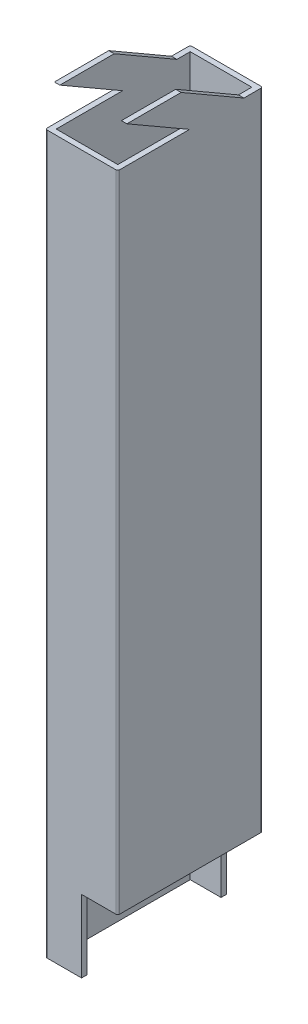
ISO-10303-21;
HEADER;
FILE_DESCRIPTION(('STEP AP214'),'2;1');
FILE_NAME('part.step','',(''),(''),'','','');
FILE_SCHEMA(('AUTOMOTIVE_DESIGN { 1 0 10303 214 1 1 1 1 }'));
ENDSEC;
DATA;
#1=APPLICATION_CONTEXT('core data for automotive mechanical design processes');
#2=APPLICATION_PROTOCOL_DEFINITION('international standard','automotive_design',2000,#1);
#3=PRODUCT_CONTEXT('',#1,'mechanical');
#4=PRODUCT('Part','Part','',(#3));
#5=PRODUCT_RELATED_PRODUCT_CATEGORY('part','',(#4));
#6=PRODUCT_DEFINITION_FORMATION('','',#4);
#7=PRODUCT_DEFINITION_CONTEXT('part definition',#1,'design');
#8=PRODUCT_DEFINITION('design','',#6,#7);
#9=PRODUCT_DEFINITION_SHAPE('','',#8);
#10=(LENGTH_UNIT() NAMED_UNIT(*) SI_UNIT(.MILLI.,.METRE.));
#11=(NAMED_UNIT(*) PLANE_ANGLE_UNIT() SI_UNIT($,.RADIAN.));
#12=(NAMED_UNIT(*) SI_UNIT($,.STERADIAN.) SOLID_ANGLE_UNIT());
#13=UNCERTAINTY_MEASURE_WITH_UNIT(LENGTH_MEASURE(1.E-05),#10,'distance_accuracy_value','');
#14=(GEOMETRIC_REPRESENTATION_CONTEXT(3) GLOBAL_UNCERTAINTY_ASSIGNED_CONTEXT((#13)) GLOBAL_UNIT_ASSIGNED_CONTEXT((#10,
#11,#12)) REPRESENTATION_CONTEXT('',''));
#15=CARTESIAN_POINT('',(0.,0.,0.));
#16=DIRECTION('',(0.,0.,1.));
#17=DIRECTION('',(1.,0.,0.));
#18=AXIS2_PLACEMENT_3D('',#15,#16,#17);
#19=CARTESIAN_POINT('',(19.5,208.,-0.5));
#20=DIRECTION('',(0.,1.,0.));
#21=DIRECTION('',(0.,0.,1.));
#22=AXIS2_PLACEMENT_3D('',#19,#20,#21);
#23=PLANE('',#22);
#24=DIRECTION('',(0.,0.,-1.));
#25=VECTOR('',#24,1.);
#26=CARTESIAN_POINT('',(20.,208.,-0.5));
#27=LINE('',#26,#25);
#28=CARTESIAN_POINT('',(20.,208.,-2.5));
#29=VERTEX_POINT('',#28);
#30=CARTESIAN_POINT('',(20.,208.,-17.5));
#31=VERTEX_POINT('',#30);
#32=EDGE_CURVE('E226',#29,#31,#27,.T.);
#33=ORIENTED_EDGE('',*,*,#32,.T.);
#34=DIRECTION('',(-1.,0.,0.));
#35=VECTOR('',#34,1.);
#36=CARTESIAN_POINT('',(40.,208.,-17.5));
#37=LINE('',#36,#35);
#38=CARTESIAN_POINT('',(18.5,208.,-17.5));
#39=VERTEX_POINT('',#38);
#40=EDGE_CURVE('E217',#31,#39,#37,.T.);
#41=ORIENTED_EDGE('',*,*,#40,.T.);
#42=DIRECTION('',(0.,0.,-1.));
#43=VECTOR('',#42,1.);
#44=CARTESIAN_POINT('',(18.5,208.,-1.5));
#45=LINE('',#44,#43);
#46=CARTESIAN_POINT('',(18.5,208.,-2.5));
#47=VERTEX_POINT('',#46);
#48=EDGE_CURVE('E347',#47,#39,#45,.T.);
#49=ORIENTED_EDGE('',*,*,#48,.F.);
#50=DIRECTION('',(-1.,0.,0.));
#51=VECTOR('',#50,1.);
#52=CARTESIAN_POINT('',(40.,208.,-2.5));
#53=LINE('',#52,#51);
#54=EDGE_CURVE('E51',#29,#47,#53,.T.);
#55=ORIENTED_EDGE('',*,*,#54,.F.);
#56=EDGE_LOOP('',(#33,#41,#49,#55));
#57=FACE_BOUND('',#56,.T.);
#58=ADVANCED_FACE('F36',(#57),#23,.T.);
#59=DIRECTION('',(0.,0.,1.));
#60=VECTOR('',#59,1.);
#61=CARTESIAN_POINT('',(1.5,208.,-1.5));
#62=LINE('',#61,#60);
#63=CARTESIAN_POINT('',(1.5,208.,-17.5));
#64=VERTEX_POINT('',#63);
#65=CARTESIAN_POINT('',(1.5,208.,-2.5));
#66=VERTEX_POINT('',#65);
#67=EDGE_CURVE('E216',#64,#66,#62,.T.);
#68=ORIENTED_EDGE('',*,*,#67,.F.);
#69=CARTESIAN_POINT('',(0.,208.,-17.5));
#70=VERTEX_POINT('',#69);
#71=EDGE_CURVE('E200',#64,#70,#37,.T.);
#72=ORIENTED_EDGE('',*,*,#71,.T.);
#73=DIRECTION('',(0.,0.,1.));
#74=VECTOR('',#73,1.);
#75=CARTESIAN_POINT('',(0.,208.,-0.500000000000004));
#76=LINE('',#75,#74);
#77=CARTESIAN_POINT('',(0.,208.,-2.5));
#78=VERTEX_POINT('',#77);
#79=EDGE_CURVE('E214',#70,#78,#76,.T.);
#80=ORIENTED_EDGE('',*,*,#79,.T.);
#81=EDGE_CURVE('E392',#66,#78,#53,.T.);
#82=ORIENTED_EDGE('',*,*,#81,.F.);
#83=EDGE_LOOP('',(#68,#72,#80,#82));
#84=FACE_BOUND('',#83,.T.);
#85=ADVANCED_FACE('F212',(#84),#23,.T.);
#86=CARTESIAN_POINT('',(19.5,208.,-0.5));
#87=DIRECTION('',(0.,-1.,0.));
#88=DIRECTION('',(0.,0.,-1.));
#89=AXIS2_PLACEMENT_3D('',#86,#87,#88);
#90=CYLINDRICAL_SURFACE('',#89,0.5);
#91=CARTESIAN_POINT('',(19.5,198.,-0.5));
#92=DIRECTION('',(0.,1.,0.));
#93=DIRECTION('',(0.,0.,1.));
#94=AXIS2_PLACEMENT_3D('',#91,#92,#93);
#95=CIRCLE('',#94,0.5);
#96=CARTESIAN_POINT('',(19.5,198.,0.));
#97=VERTEX_POINT('',#96);
#98=CARTESIAN_POINT('',(20.,198.,-0.5));
#99=VERTEX_POINT('',#98);
#100=EDGE_CURVE('E304',#97,#99,#95,.T.);
#101=ORIENTED_EDGE('',*,*,#100,.F.);
#102=DIRECTION('',(0.,-1.,0.));
#103=VECTOR('',#102,1.);
#104=CARTESIAN_POINT('',(19.5,208.,0.));
#105=LINE('',#104,#103);
#106=CARTESIAN_POINT('',(19.5,20.,0.));
#107=VERTEX_POINT('',#106);
#108=EDGE_CURVE('E225',#97,#107,#105,.T.);
#109=ORIENTED_EDGE('',*,*,#108,.T.);
#110=CARTESIAN_POINT('',(19.5,20.,-0.5));
#111=DIRECTION('',(0.,1.,0.));
#112=DIRECTION('',(0.,0.,1.));
#113=AXIS2_PLACEMENT_3D('',#110,#111,#112);
#114=CIRCLE('',#113,0.5);
#115=CARTESIAN_POINT('',(20.,20.,-0.5));
#116=VERTEX_POINT('',#115);
#117=EDGE_CURVE('E340',#107,#116,#114,.T.);
#118=ORIENTED_EDGE('',*,*,#117,.T.);
#119=DIRECTION('',(0.,-1.,0.));
#120=VECTOR('',#119,1.);
#121=CARTESIAN_POINT('',(20.,208.,-0.5));
#122=LINE('',#121,#120);
#123=EDGE_CURVE('E261',#99,#116,#122,.T.);
#124=ORIENTED_EDGE('',*,*,#123,.F.);
#125=EDGE_LOOP('',(#101,#109,#118,#124));
#126=FACE_BOUND('',#125,.T.);
#127=ADVANCED_FACE('F38',(#126),#90,.T.);
#128=CARTESIAN_POINT('',(20.,208.,-0.5));
#129=DIRECTION('',(-1.,0.,0.));
#130=DIRECTION('',(0.,0.,1.));
#131=AXIS2_PLACEMENT_3D('',#128,#129,#130);
#132=PLANE('',#131);
#133=DIRECTION('',(0.,-0.500000000000001,-0.866025403784438));
#134=VECTOR('',#133,1.);
#135=CARTESIAN_POINT('',(20.,215.361215932168,-4.75000000000001));
#136=LINE('',#135,#134);
#137=CARTESIAN_POINT('',(20.,198.,-34.8205080756887));
#138=VERTEX_POINT('',#137);
#139=EDGE_CURVE('E308',#31,#138,#136,.T.);
#140=ORIENTED_EDGE('',*,*,#139,.F.);
#141=ORIENTED_EDGE('',*,*,#32,.F.);
#142=DIRECTION('',(0.,0.500000000000002,0.866025403784438));
#143=VECTOR('',#142,1.);
#144=CARTESIAN_POINT('',(20.,208.866025403784,-1.));
#145=LINE('',#144,#143);
#146=CARTESIAN_POINT('',(20.,198.,-19.8205080756887));
#147=VERTEX_POINT('',#146);
#148=EDGE_CURVE('E293',#147,#29,#145,.T.);
#149=ORIENTED_EDGE('',*,*,#148,.F.);
#150=DIRECTION('',(0.,0.,-1.));
#151=VECTOR('',#150,1.);
#152=CARTESIAN_POINT('',(20.,198.,-0.5));
#153=LINE('',#152,#151);
#154=EDGE_CURVE('E302',#99,#147,#153,.T.);
#155=ORIENTED_EDGE('',*,*,#154,.F.);
#156=ORIENTED_EDGE('',*,*,#123,.T.);
#157=DIRECTION('',(0.,0.,1.));
#158=VECTOR('',#157,1.);
#159=CARTESIAN_POINT('',(20.,20.,-40.));
#160=LINE('',#159,#158);
#161=CARTESIAN_POINT('',(20.,20.,-39.5));
#162=VERTEX_POINT('',#161);
#163=EDGE_CURVE('E318',#162,#116,#160,.T.);
#164=ORIENTED_EDGE('',*,*,#163,.F.);
#165=DIRECTION('',(0.,-1.,0.));
#166=VECTOR('',#165,1.);
#167=CARTESIAN_POINT('',(20.,208.,-39.5));
#168=LINE('',#167,#166);
#169=CARTESIAN_POINT('',(20.,198.,-39.5));
#170=VERTEX_POINT('',#169);
#171=EDGE_CURVE('E259',#170,#162,#168,.T.);
#172=ORIENTED_EDGE('',*,*,#171,.F.);
#173=DIRECTION('',(0.,0.,-1.));
#174=VECTOR('',#173,1.);
#175=CARTESIAN_POINT('',(20.,198.,-0.5));
#176=LINE('',#175,#174);
#177=EDGE_CURVE('E388',#138,#170,#176,.T.);
#178=ORIENTED_EDGE('',*,*,#177,.F.);
#179=EDGE_LOOP('',(#140,#141,#149,#155,#156,#164,#172,#178));
#180=FACE_BOUND('',#179,.T.);
#181=ADVANCED_FACE('F428',(#180),#132,.F.);
#182=CARTESIAN_POINT('',(19.5,208.,-39.5));
#183=DIRECTION('',(0.,-1.,0.));
#184=DIRECTION('',(0.,0.,-1.));
#185=AXIS2_PLACEMENT_3D('',#182,#183,#184);
#186=CYLINDRICAL_SURFACE('',#185,0.5);
#187=CARTESIAN_POINT('',(19.5,198.,-39.5));
#188=DIRECTION('',(0.,1.,0.));
#189=DIRECTION('',(0.,0.,1.));
#190=AXIS2_PLACEMENT_3D('',#187,#188,#189);
#191=CIRCLE('',#190,0.5);
#192=CARTESIAN_POINT('',(19.5,198.,-40.));
#193=VERTEX_POINT('',#192);
#194=EDGE_CURVE('E380',#170,#193,#191,.T.);
#195=ORIENTED_EDGE('',*,*,#194,.F.);
#196=ORIENTED_EDGE('',*,*,#171,.T.);
#197=CARTESIAN_POINT('',(19.5,20.,-39.5));
#198=DIRECTION('',(0.,1.,0.));
#199=DIRECTION('',(0.,0.,1.));
#200=AXIS2_PLACEMENT_3D('',#197,#198,#199);
#201=CIRCLE('',#200,0.5);
#202=CARTESIAN_POINT('',(19.5,20.,-40.));
#203=VERTEX_POINT('',#202);
#204=EDGE_CURVE('E337',#162,#203,#201,.T.);
#205=ORIENTED_EDGE('',*,*,#204,.T.);
#206=DIRECTION('',(0.,-1.,0.));
#207=VECTOR('',#206,1.);
#208=CARTESIAN_POINT('',(19.5,208.,-40.));
#209=LINE('',#208,#207);
#210=EDGE_CURVE('E257',#193,#203,#209,.T.);
#211=ORIENTED_EDGE('',*,*,#210,.F.);
#212=EDGE_LOOP('',(#195,#196,#205,#211));
#213=FACE_BOUND('',#212,.T.);
#214=ADVANCED_FACE('F458',(#213),#186,.T.);
#215=CARTESIAN_POINT('',(0.500000000000004,208.,-40.));
#216=DIRECTION('',(0.,0.,1.));
#217=DIRECTION('',(1.,0.,0.));
#218=AXIS2_PLACEMENT_3D('',#215,#216,#217);
#219=PLANE('',#218);
#220=DIRECTION('',(-1.,0.,0.));
#221=VECTOR('',#220,1.);
#222=CARTESIAN_POINT('',(40.,198.,-40.));
#223=LINE('',#222,#221);
#224=CARTESIAN_POINT('',(0.5,198.,-40.));
#225=VERTEX_POINT('',#224);
#226=EDGE_CURVE('E439',#193,#225,#223,.T.);
#227=ORIENTED_EDGE('',*,*,#226,.F.);
#228=ORIENTED_EDGE('',*,*,#210,.T.);
#229=DIRECTION('',(-1.,0.,0.));
#230=VECTOR('',#229,1.);
#231=CARTESIAN_POINT('',(20.,20.,-40.));
#232=LINE('',#231,#230);
#233=CARTESIAN_POINT('',(10.,20.,-40.));
#234=VERTEX_POINT('',#233);
#235=EDGE_CURVE('E311',#203,#234,#232,.T.);
#236=ORIENTED_EDGE('',*,*,#235,.T.);
#237=DIRECTION('',(0.,-1.,0.));
#238=VECTOR('',#237,1.);
#239=CARTESIAN_POINT('',(10.,20.,-40.));
#240=LINE('',#239,#238);
#241=CARTESIAN_POINT('',(10.,0.,-40.));
#242=VERTEX_POINT('',#241);
#243=EDGE_CURVE('E314',#234,#242,#240,.T.);
#244=ORIENTED_EDGE('',*,*,#243,.T.);
#245=DIRECTION('',(-1.,0.,0.));
#246=VECTOR('',#245,1.);
#247=CARTESIAN_POINT('',(0.500000000000004,0.,-40.));
#248=LINE('',#247,#246);
#249=CARTESIAN_POINT('',(0.5,0.,-40.));
#250=VERTEX_POINT('',#249);
#251=EDGE_CURVE('E235',#242,#250,#248,.T.);
#252=ORIENTED_EDGE('',*,*,#251,.T.);
#253=DIRECTION('',(0.,-1.,0.));
#254=VECTOR('',#253,1.);
#255=CARTESIAN_POINT('',(0.5,208.,-40.));
#256=LINE('',#255,#254);
#257=EDGE_CURVE('E255',#225,#250,#256,.T.);
#258=ORIENTED_EDGE('',*,*,#257,.F.);
#259=EDGE_LOOP('',(#227,#228,#236,#244,#252,#258));
#260=FACE_BOUND('',#259,.T.);
#261=ADVANCED_FACE('F450',(#260),#219,.F.);
#262=CARTESIAN_POINT('',(0.5,208.,-39.5));
#263=DIRECTION('',(0.,-1.,0.));
#264=DIRECTION('',(0.,0.,-1.));
#265=AXIS2_PLACEMENT_3D('',#262,#263,#264);
#266=CYLINDRICAL_SURFACE('',#265,0.5);
#267=CARTESIAN_POINT('',(0.5,198.,-39.5));
#268=DIRECTION('',(0.,1.,0.));
#269=DIRECTION('',(0.,0.,1.));
#270=AXIS2_PLACEMENT_3D('',#267,#268,#269);
#271=CIRCLE('',#270,0.5);
#272=CARTESIAN_POINT('',(0.,198.,-39.5));
#273=VERTEX_POINT('',#272);
#274=EDGE_CURVE('E377',#225,#273,#271,.T.);
#275=ORIENTED_EDGE('',*,*,#274,.F.);
#276=ORIENTED_EDGE('',*,*,#257,.T.);
#277=CARTESIAN_POINT('',(0.5,0.,-39.5));
#278=DIRECTION('',(0.,1.,0.));
#279=DIRECTION('',(0.,0.,-1.));
#280=AXIS2_PLACEMENT_3D('',#277,#278,#279);
#281=CIRCLE('',#280,0.5);
#282=CARTESIAN_POINT('',(0.,0.,-39.5));
#283=VERTEX_POINT('',#282);
#284=EDGE_CURVE('E238',#250,#283,#281,.T.);
#285=ORIENTED_EDGE('',*,*,#284,.T.);
#286=DIRECTION('',(0.,-1.,0.));
#287=VECTOR('',#286,1.);
#288=CARTESIAN_POINT('',(0.,208.,-39.5));
#289=LINE('',#288,#287);
#290=EDGE_CURVE('E253',#273,#283,#289,.T.);
#291=ORIENTED_EDGE('',*,*,#290,.F.);
#292=EDGE_LOOP('',(#275,#276,#285,#291));
#293=FACE_BOUND('',#292,.T.);
#294=ADVANCED_FACE('F446',(#293),#266,.T.);
#295=CARTESIAN_POINT('',(0.,208.,-0.500000000000004));
#296=DIRECTION('',(1.,0.,0.));
#297=DIRECTION('',(0.,0.,-1.));
#298=AXIS2_PLACEMENT_3D('',#295,#296,#297);
#299=PLANE('',#298);
#300=DIRECTION('',(0.,-0.500000000000001,-0.866025403784438));
#301=VECTOR('',#300,1.);
#302=CARTESIAN_POINT('',(0.,208.,-17.5));
#303=LINE('',#302,#301);
#304=CARTESIAN_POINT('',(0.,198.,-34.8205080756887));
#305=VERTEX_POINT('',#304);
#306=EDGE_CURVE('E197',#70,#305,#303,.T.);
#307=ORIENTED_EDGE('',*,*,#306,.T.);
#308=DIRECTION('',(0.,0.,-1.));
#309=VECTOR('',#308,1.);
#310=CARTESIAN_POINT('',(0.,198.,-34.8205080756887));
#311=LINE('',#310,#309);
#312=EDGE_CURVE('E207',#305,#273,#311,.T.);
#313=ORIENTED_EDGE('',*,*,#312,.T.);
#314=ORIENTED_EDGE('',*,*,#290,.T.);
#315=DIRECTION('',(0.,0.,1.));
#316=VECTOR('',#315,1.);
#317=CARTESIAN_POINT('',(0.,0.,-0.500000000000004));
#318=LINE('',#317,#316);
#319=CARTESIAN_POINT('',(0.,0.,-0.500000000000003));
#320=VERTEX_POINT('',#319);
#321=EDGE_CURVE('E242',#283,#320,#318,.T.);
#322=ORIENTED_EDGE('',*,*,#321,.T.);
#323=DIRECTION('',(0.,-1.,0.));
#324=VECTOR('',#323,1.);
#325=CARTESIAN_POINT('',(0.,208.,-0.500000000000003));
#326=LINE('',#325,#324);
#327=CARTESIAN_POINT('',(0.,198.,-0.5));
#328=VERTEX_POINT('',#327);
#329=EDGE_CURVE('E251',#328,#320,#326,.T.);
#330=ORIENTED_EDGE('',*,*,#329,.F.);
#331=DIRECTION('',(0.,0.,-1.));
#332=VECTOR('',#331,1.);
#333=CARTESIAN_POINT('',(0.,198.,0.));
#334=LINE('',#333,#332);
#335=CARTESIAN_POINT('',(0.,198.,-19.8205080756887));
#336=VERTEX_POINT('',#335);
#337=EDGE_CURVE('E395',#328,#336,#334,.T.);
#338=ORIENTED_EDGE('',*,*,#337,.T.);
#339=DIRECTION('',(0.,0.500000000000002,0.866025403784438));
#340=VECTOR('',#339,1.);
#341=CARTESIAN_POINT('',(0.,198.,-19.8205080756887));
#342=LINE('',#341,#340);
#343=EDGE_CURVE('E224',#336,#78,#342,.T.);
#344=ORIENTED_EDGE('',*,*,#343,.T.);
#345=ORIENTED_EDGE('',*,*,#79,.F.);
#346=EDGE_LOOP('',(#307,#313,#314,#322,#330,#338,#344,#345));
#347=FACE_BOUND('',#346,.T.);
#348=ADVANCED_FACE('F221',(#347),#299,.F.);
#349=CARTESIAN_POINT('',(0.5,208.,-0.5));
#350=DIRECTION('',(0.,-1.,0.));
#351=DIRECTION('',(0.,0.,-1.));
#352=AXIS2_PLACEMENT_3D('',#349,#350,#351);
#353=CYLINDRICAL_SURFACE('',#352,0.5);
#354=CARTESIAN_POINT('',(0.5,198.,-0.5));
#355=DIRECTION('',(0.,1.,0.));
#356=DIRECTION('',(0.,0.,1.));
#357=AXIS2_PLACEMENT_3D('',#354,#355,#356);
#358=CIRCLE('',#357,0.5);
#359=CARTESIAN_POINT('',(0.5,198.,0.));
#360=VERTEX_POINT('',#359);
#361=EDGE_CURVE('E295',#328,#360,#358,.T.);
#362=ORIENTED_EDGE('',*,*,#361,.F.);
#363=ORIENTED_EDGE('',*,*,#329,.T.);
#364=CARTESIAN_POINT('',(0.5,0.,-0.5));
#365=DIRECTION('',(0.,1.,0.));
#366=DIRECTION('',(0.,0.,-1.));
#367=AXIS2_PLACEMENT_3D('',#364,#365,#366);
#368=CIRCLE('',#367,0.5);
#369=CARTESIAN_POINT('',(0.500000000000004,0.,0.));
#370=VERTEX_POINT('',#369);
#371=EDGE_CURVE('E245',#320,#370,#368,.T.);
#372=ORIENTED_EDGE('',*,*,#371,.T.);
#373=DIRECTION('',(0.,-1.,0.));
#374=VECTOR('',#373,1.);
#375=CARTESIAN_POINT('',(0.500000000000004,208.,0.));
#376=LINE('',#375,#374);
#377=EDGE_CURVE('E228',#360,#370,#376,.T.);
#378=ORIENTED_EDGE('',*,*,#377,.F.);
#379=EDGE_LOOP('',(#362,#363,#372,#378));
#380=FACE_BOUND('',#379,.T.);
#381=ADVANCED_FACE('F408',(#380),#353,.T.);
#382=CARTESIAN_POINT('',(0.500000000000004,208.,0.));
#383=DIRECTION('',(0.,0.,-1.));
#384=DIRECTION('',(-1.,0.,0.));
#385=AXIS2_PLACEMENT_3D('',#382,#383,#384);
#386=PLANE('',#385);
#387=DIRECTION('',(-1.,0.,0.));
#388=VECTOR('',#387,1.);
#389=CARTESIAN_POINT('',(40.,198.,0.));
#390=LINE('',#389,#388);
#391=EDGE_CURVE('E383',#97,#360,#390,.T.);
#392=ORIENTED_EDGE('',*,*,#391,.T.);
#393=ORIENTED_EDGE('',*,*,#377,.T.);
#394=DIRECTION('',(1.,0.,0.));
#395=VECTOR('',#394,1.);
#396=CARTESIAN_POINT('',(0.500000000000004,0.,0.));
#397=LINE('',#396,#395);
#398=CARTESIAN_POINT('',(10.,0.,0.));
#399=VERTEX_POINT('',#398);
#400=EDGE_CURVE('E231',#370,#399,#397,.T.);
#401=ORIENTED_EDGE('',*,*,#400,.T.);
#402=DIRECTION('',(0.,-1.,0.));
#403=VECTOR('',#402,1.);
#404=CARTESIAN_POINT('',(10.,20.,0.));
#405=LINE('',#404,#403);
#406=CARTESIAN_POINT('',(10.,20.,0.));
#407=VERTEX_POINT('',#406);
#408=EDGE_CURVE('E315',#407,#399,#405,.T.);
#409=ORIENTED_EDGE('',*,*,#408,.F.);
#410=DIRECTION('',(-1.,0.,0.));
#411=VECTOR('',#410,1.);
#412=CARTESIAN_POINT('',(20.,20.,0.));
#413=LINE('',#412,#411);
#414=EDGE_CURVE('E310',#107,#407,#413,.T.);
#415=ORIENTED_EDGE('',*,*,#414,.F.);
#416=ORIENTED_EDGE('',*,*,#108,.F.);
#417=EDGE_LOOP('',(#392,#393,#401,#409,#415,#416));
#418=FACE_BOUND('',#417,.T.);
#419=ADVANCED_FACE('F403',(#418),#386,.F.);
#420=CARTESIAN_POINT('',(1.5,208.,-1.5));
#421=DIRECTION('',(1.,0.,0.));
#422=DIRECTION('',(0.,0.,-1.));
#423=AXIS2_PLACEMENT_3D('',#420,#421,#422);
#424=PLANE('',#423);
#425=DIRECTION('',(0.,0.,1.));
#426=VECTOR('',#425,1.);
#427=CARTESIAN_POINT('',(1.5,198.,-1.5));
#428=LINE('',#427,#426);
#429=CARTESIAN_POINT('',(1.5,198.,-38.5));
#430=VERTEX_POINT('',#429);
#431=CARTESIAN_POINT('',(1.5,198.,-34.8205080756887));
#432=VERTEX_POINT('',#431);
#433=EDGE_CURVE('E59',#430,#432,#428,.T.);
#434=ORIENTED_EDGE('',*,*,#433,.T.);
#435=DIRECTION('',(0.,0.500000000000001,0.866025403784438));
#436=VECTOR('',#435,1.);
#437=CARTESIAN_POINT('',(1.5,214.928203230275,-5.50000000000001));
#438=LINE('',#437,#436);
#439=EDGE_CURVE('E306',#432,#64,#438,.T.);
#440=ORIENTED_EDGE('',*,*,#439,.T.);
#441=ORIENTED_EDGE('',*,*,#67,.T.);
#442=DIRECTION('',(0.,-0.500000000000002,-0.866025403784438));
#443=VECTOR('',#442,1.);
#444=CARTESIAN_POINT('',(1.5,208.433012701892,-1.75));
#445=LINE('',#444,#443);
#446=CARTESIAN_POINT('',(1.5,198.,-19.8205080756887));
#447=VERTEX_POINT('',#446);
#448=EDGE_CURVE('E297',#66,#447,#445,.T.);
#449=ORIENTED_EDGE('',*,*,#448,.T.);
#450=DIRECTION('',(0.,0.,1.));
#451=VECTOR('',#450,1.);
#452=CARTESIAN_POINT('',(1.5,198.,-1.5));
#453=LINE('',#452,#451);
#454=CARTESIAN_POINT('',(1.5,198.,-1.5));
#455=VERTEX_POINT('',#454);
#456=EDGE_CURVE('E292',#447,#455,#453,.T.);
#457=ORIENTED_EDGE('',*,*,#456,.T.);
#458=DIRECTION('',(0.,-1.,0.));
#459=VECTOR('',#458,1.);
#460=CARTESIAN_POINT('',(1.5,208.,-1.5));
#461=LINE('',#460,#459);
#462=CARTESIAN_POINT('',(1.5,0.,-1.5));
#463=VERTEX_POINT('',#462);
#464=EDGE_CURVE('E239',#455,#463,#461,.T.);
#465=ORIENTED_EDGE('',*,*,#464,.T.);
#466=DIRECTION('',(0.,0.,1.));
#467=VECTOR('',#466,1.);
#468=CARTESIAN_POINT('',(1.5,0.,-1.5));
#469=LINE('',#468,#467);
#470=CARTESIAN_POINT('',(1.5,0.,-38.5));
#471=VERTEX_POINT('',#470);
#472=EDGE_CURVE('E345',#471,#463,#469,.T.);
#473=ORIENTED_EDGE('',*,*,#472,.F.);
#474=DIRECTION('',(0.,-1.,0.));
#475=VECTOR('',#474,1.);
#476=CARTESIAN_POINT('',(1.5,208.,-38.5));
#477=LINE('',#476,#475);
#478=EDGE_CURVE('E350',#430,#471,#477,.T.);
#479=ORIENTED_EDGE('',*,*,#478,.F.);
#480=EDGE_LOOP('',(#434,#440,#441,#449,#457,#465,#473,#479));
#481=FACE_BOUND('',#480,.T.);
#482=ADVANCED_FACE('F363',(#481),#424,.T.);
#483=CARTESIAN_POINT('',(1.5,208.,-1.5));
#484=DIRECTION('',(0.,0.,-1.));
#485=DIRECTION('',(-1.,0.,0.));
#486=AXIS2_PLACEMENT_3D('',#483,#484,#485);
#487=PLANE('',#486);
#488=ORIENTED_EDGE('',*,*,#464,.F.);
#489=DIRECTION('',(1.,0.,0.));
#490=VECTOR('',#489,1.);
#491=CARTESIAN_POINT('',(1.5,198.,-1.5));
#492=LINE('',#491,#490);
#493=CARTESIAN_POINT('',(18.5,198.,-1.5));
#494=VERTEX_POINT('',#493);
#495=EDGE_CURVE('E282',#455,#494,#492,.T.);
#496=ORIENTED_EDGE('',*,*,#495,.T.);
#497=DIRECTION('',(0.,-1.,0.));
#498=VECTOR('',#497,1.);
#499=CARTESIAN_POINT('',(18.5,208.,-1.5));
#500=LINE('',#499,#498);
#501=CARTESIAN_POINT('',(18.5,20.,-1.5));
#502=VERTEX_POINT('',#501);
#503=EDGE_CURVE('E277',#494,#502,#500,.T.);
#504=ORIENTED_EDGE('',*,*,#503,.T.);
#505=DIRECTION('',(1.,0.,0.));
#506=VECTOR('',#505,1.);
#507=CARTESIAN_POINT('',(1.5,20.,-1.5));
#508=LINE('',#507,#506);
#509=CARTESIAN_POINT('',(10.,20.,-1.5));
#510=VERTEX_POINT('',#509);
#511=EDGE_CURVE('E335',#510,#502,#508,.T.);
#512=ORIENTED_EDGE('',*,*,#511,.F.);
#513=DIRECTION('',(0.,1.,0.));
#514=VECTOR('',#513,1.);
#515=CARTESIAN_POINT('',(10.,208.,-1.5));
#516=LINE('',#515,#514);
#517=CARTESIAN_POINT('',(10.,0.,-1.5));
#518=VERTEX_POINT('',#517);
#519=EDGE_CURVE('E343',#518,#510,#516,.T.);
#520=ORIENTED_EDGE('',*,*,#519,.F.);
#521=DIRECTION('',(1.,0.,0.));
#522=VECTOR('',#521,1.);
#523=CARTESIAN_POINT('',(1.5,0.,-1.5));
#524=LINE('',#523,#522);
#525=EDGE_CURVE('E353',#463,#518,#524,.T.);
#526=ORIENTED_EDGE('',*,*,#525,.F.);
#527=EDGE_LOOP('',(#488,#496,#504,#512,#520,#526));
#528=FACE_BOUND('',#527,.T.);
#529=ADVANCED_FACE('F288',(#528),#487,.T.);
#530=CARTESIAN_POINT('',(18.5,208.,-1.5));
#531=DIRECTION('',(-1.,0.,0.));
#532=DIRECTION('',(0.,0.,1.));
#533=AXIS2_PLACEMENT_3D('',#530,#531,#532);
#534=PLANE('',#533);
#535=ORIENTED_EDGE('',*,*,#48,.T.);
#536=DIRECTION('',(0.,-0.500000000000001,-0.866025403784438));
#537=VECTOR('',#536,1.);
#538=CARTESIAN_POINT('',(18.5,214.928203230275,-5.50000000000001));
#539=LINE('',#538,#537);
#540=CARTESIAN_POINT('',(18.5,198.,-34.8205080756887));
#541=VERTEX_POINT('',#540);
#542=EDGE_CURVE('E11',#39,#541,#539,.T.);
#543=ORIENTED_EDGE('',*,*,#542,.T.);
#544=DIRECTION('',(0.,0.,-1.));
#545=VECTOR('',#544,1.);
#546=CARTESIAN_POINT('',(18.5,198.,-1.5));
#547=LINE('',#546,#545);
#548=CARTESIAN_POINT('',(18.5,198.,-38.5));
#549=VERTEX_POINT('',#548);
#550=EDGE_CURVE('E378',#541,#549,#547,.T.);
#551=ORIENTED_EDGE('',*,*,#550,.T.);
#552=DIRECTION('',(0.,-1.,0.));
#553=VECTOR('',#552,1.);
#554=CARTESIAN_POINT('',(18.5,208.,-38.5));
#555=LINE('',#554,#553);
#556=CARTESIAN_POINT('',(18.5,20.,-38.5));
#557=VERTEX_POINT('',#556);
#558=EDGE_CURVE('E359',#549,#557,#555,.T.);
#559=ORIENTED_EDGE('',*,*,#558,.T.);
#560=DIRECTION('',(0.,0.,-1.));
#561=VECTOR('',#560,1.);
#562=CARTESIAN_POINT('',(18.5,20.,-1.5));
#563=LINE('',#562,#561);
#564=EDGE_CURVE('E325',#502,#557,#563,.T.);
#565=ORIENTED_EDGE('',*,*,#564,.F.);
#566=ORIENTED_EDGE('',*,*,#503,.F.);
#567=DIRECTION('',(0.,0.,-1.));
#568=VECTOR('',#567,1.);
#569=CARTESIAN_POINT('',(18.5,198.,-1.5));
#570=LINE('',#569,#568);
#571=CARTESIAN_POINT('',(18.5,198.,-19.8205080756887));
#572=VERTEX_POINT('',#571);
#573=EDGE_CURVE('E44',#494,#572,#570,.T.);
#574=ORIENTED_EDGE('',*,*,#573,.T.);
#575=DIRECTION('',(0.,0.500000000000002,0.866025403784438));
#576=VECTOR('',#575,1.);
#577=CARTESIAN_POINT('',(18.5,208.433012701892,-1.75));
#578=LINE('',#577,#576);
#579=EDGE_CURVE('E269',#572,#47,#578,.T.);
#580=ORIENTED_EDGE('',*,*,#579,.T.);
#581=EDGE_LOOP('',(#535,#543,#551,#559,#565,#566,#574,#580));
#582=FACE_BOUND('',#581,.T.);
#583=ADVANCED_FACE('F274',(#582),#534,.T.);
#584=CARTESIAN_POINT('',(1.5,208.,-38.5));
#585=DIRECTION('',(0.,0.,1.));
#586=DIRECTION('',(1.,0.,0.));
#587=AXIS2_PLACEMENT_3D('',#584,#585,#586);
#588=PLANE('',#587);
#589=ORIENTED_EDGE('',*,*,#558,.F.);
#590=DIRECTION('',(-1.,0.,0.));
#591=VECTOR('',#590,1.);
#592=CARTESIAN_POINT('',(1.5,198.,-38.5));
#593=LINE('',#592,#591);
#594=EDGE_CURVE('E267',#549,#430,#593,.T.);
#595=ORIENTED_EDGE('',*,*,#594,.T.);
#596=ORIENTED_EDGE('',*,*,#478,.T.);
#597=DIRECTION('',(-1.,0.,0.));
#598=VECTOR('',#597,1.);
#599=CARTESIAN_POINT('',(1.5,0.,-38.5));
#600=LINE('',#599,#598);
#601=CARTESIAN_POINT('',(10.,0.,-38.5));
#602=VERTEX_POINT('',#601);
#603=EDGE_CURVE('E348',#602,#471,#600,.T.);
#604=ORIENTED_EDGE('',*,*,#603,.F.);
#605=DIRECTION('',(0.,-1.,0.));
#606=VECTOR('',#605,1.);
#607=CARTESIAN_POINT('',(10.,208.,-38.5));
#608=LINE('',#607,#606);
#609=CARTESIAN_POINT('',(10.,20.,-38.5));
#610=VERTEX_POINT('',#609);
#611=EDGE_CURVE('E265',#610,#602,#608,.T.);
#612=ORIENTED_EDGE('',*,*,#611,.F.);
#613=DIRECTION('',(-1.,0.,0.));
#614=VECTOR('',#613,1.);
#615=CARTESIAN_POINT('',(1.5,20.,-38.5));
#616=LINE('',#615,#614);
#617=EDGE_CURVE('E263',#557,#610,#616,.T.);
#618=ORIENTED_EDGE('',*,*,#617,.F.);
#619=EDGE_LOOP('',(#589,#595,#596,#604,#612,#618));
#620=FACE_BOUND('',#619,.T.);
#621=ADVANCED_FACE('F375',(#620),#588,.T.);
#622=CARTESIAN_POINT('',(19.5,0.,-0.5));
#623=DIRECTION('',(0.,1.,0.));
#624=DIRECTION('',(0.,0.,1.));
#625=AXIS2_PLACEMENT_3D('',#622,#623,#624);
#626=PLANE('',#625);
#627=ORIENTED_EDGE('',*,*,#251,.F.);
#628=DIRECTION('',(0.,0.,1.));
#629=VECTOR('',#628,1.);
#630=CARTESIAN_POINT('',(10.,0.,-40.));
#631=LINE('',#630,#629);
#632=EDGE_CURVE('E322',#242,#602,#631,.T.);
#633=ORIENTED_EDGE('',*,*,#632,.T.);
#634=ORIENTED_EDGE('',*,*,#603,.T.);
#635=ORIENTED_EDGE('',*,*,#472,.T.);
#636=ORIENTED_EDGE('',*,*,#525,.T.);
#637=EDGE_CURVE('E326',#518,#399,#631,.T.);
#638=ORIENTED_EDGE('',*,*,#637,.T.);
#639=ORIENTED_EDGE('',*,*,#400,.F.);
#640=ORIENTED_EDGE('',*,*,#371,.F.);
#641=ORIENTED_EDGE('',*,*,#321,.F.);
#642=ORIENTED_EDGE('',*,*,#284,.F.);
#643=EDGE_LOOP('',(#627,#633,#634,#635,#636,#638,#639,#640,#641,#642));
#644=FACE_BOUND('',#643,.T.);
#645=ADVANCED_FACE('F370',(#644),#626,.F.);
#646=CARTESIAN_POINT('',(10.,20.,-40.));
#647=DIRECTION('',(-1.,0.,0.));
#648=DIRECTION('',(0.,0.,1.));
#649=AXIS2_PLACEMENT_3D('',#646,#647,#648);
#650=PLANE('',#649);
#651=ORIENTED_EDGE('',*,*,#519,.T.);
#652=DIRECTION('',(0.,0.,1.));
#653=VECTOR('',#652,1.);
#654=CARTESIAN_POINT('',(10.,20.,-40.));
#655=LINE('',#654,#653);
#656=EDGE_CURVE('E330',#510,#407,#655,.T.);
#657=ORIENTED_EDGE('',*,*,#656,.T.);
#658=ORIENTED_EDGE('',*,*,#408,.T.);
#659=ORIENTED_EDGE('',*,*,#637,.F.);
#660=EDGE_LOOP('',(#651,#657,#658,#659));
#661=FACE_BOUND('',#660,.T.);
#662=ADVANCED_FACE('F415',(#661),#650,.F.);
#663=CARTESIAN_POINT('',(20.,20.,-40.));
#664=DIRECTION('',(0.,1.,0.));
#665=DIRECTION('',(0.,0.,1.));
#666=AXIS2_PLACEMENT_3D('',#663,#664,#665);
#667=PLANE('',#666);
#668=ORIENTED_EDGE('',*,*,#414,.T.);
#669=ORIENTED_EDGE('',*,*,#656,.F.);
#670=ORIENTED_EDGE('',*,*,#511,.T.);
#671=ORIENTED_EDGE('',*,*,#564,.T.);
#672=ORIENTED_EDGE('',*,*,#617,.T.);
#673=EDGE_CURVE('E327',#234,#610,#655,.T.);
#674=ORIENTED_EDGE('',*,*,#673,.F.);
#675=ORIENTED_EDGE('',*,*,#235,.F.);
#676=ORIENTED_EDGE('',*,*,#204,.F.);
#677=ORIENTED_EDGE('',*,*,#163,.T.);
#678=ORIENTED_EDGE('',*,*,#117,.F.);
#679=EDGE_LOOP('',(#668,#669,#670,#671,#672,#674,#675,#676,#677,#678));
#680=FACE_BOUND('',#679,.T.);
#681=ADVANCED_FACE('F419',(#680),#667,.F.);
#682=ORIENTED_EDGE('',*,*,#611,.T.);
#683=ORIENTED_EDGE('',*,*,#632,.F.);
#684=ORIENTED_EDGE('',*,*,#243,.F.);
#685=ORIENTED_EDGE('',*,*,#673,.T.);
#686=EDGE_LOOP('',(#682,#683,#684,#685));
#687=FACE_BOUND('',#686,.T.);
#688=ADVANCED_FACE('F454',(#687),#650,.F.);
#689=CARTESIAN_POINT('',(40.,208.,-17.5));
#690=DIRECTION('',(0.,0.866025403784438,-0.500000000000001));
#691=DIRECTION('',(0.,0.500000000000001,0.866025403784438));
#692=AXIS2_PLACEMENT_3D('',#689,#690,#691);
#693=PLANE('',#692);
#694=ORIENTED_EDGE('',*,*,#139,.T.);
#695=DIRECTION('',(-1.,0.,0.));
#696=VECTOR('',#695,1.);
#697=CARTESIAN_POINT('',(40.,198.,-34.8205080756887));
#698=LINE('',#697,#696);
#699=EDGE_CURVE('E218',#138,#541,#698,.T.);
#700=ORIENTED_EDGE('',*,*,#699,.T.);
#701=ORIENTED_EDGE('',*,*,#542,.F.);
#702=ORIENTED_EDGE('',*,*,#40,.F.);
#703=EDGE_LOOP('',(#694,#700,#701,#702));
#704=FACE_BOUND('',#703,.T.);
#705=ADVANCED_FACE('F435',(#704),#693,.T.);
#706=EDGE_CURVE('E202',#432,#305,#698,.T.);
#707=ORIENTED_EDGE('',*,*,#706,.T.);
#708=ORIENTED_EDGE('',*,*,#306,.F.);
#709=ORIENTED_EDGE('',*,*,#71,.F.);
#710=ORIENTED_EDGE('',*,*,#439,.F.);
#711=EDGE_LOOP('',(#707,#708,#709,#710));
#712=FACE_BOUND('',#711,.T.);
#713=ADVANCED_FACE('F199',(#712),#693,.T.);
#714=CARTESIAN_POINT('',(40.,198.,-34.8205080756887));
#715=DIRECTION('',(0.,1.,0.));
#716=DIRECTION('',(0.,0.,1.));
#717=AXIS2_PLACEMENT_3D('',#714,#715,#716);
#718=PLANE('',#717);
#719=ORIENTED_EDGE('',*,*,#177,.T.);
#720=ORIENTED_EDGE('',*,*,#194,.T.);
#721=ORIENTED_EDGE('',*,*,#226,.T.);
#722=ORIENTED_EDGE('',*,*,#274,.T.);
#723=ORIENTED_EDGE('',*,*,#312,.F.);
#724=ORIENTED_EDGE('',*,*,#706,.F.);
#725=ORIENTED_EDGE('',*,*,#433,.F.);
#726=ORIENTED_EDGE('',*,*,#594,.F.);
#727=ORIENTED_EDGE('',*,*,#550,.F.);
#728=ORIENTED_EDGE('',*,*,#699,.F.);
#729=EDGE_LOOP('',(#719,#720,#721,#722,#723,#724,#725,#726,#727,#728));
#730=FACE_BOUND('',#729,.T.);
#731=ADVANCED_FACE('F460',(#730),#718,.T.);
#732=CARTESIAN_POINT('',(40.,198.,0.));
#733=DIRECTION('',(0.,1.,0.));
#734=DIRECTION('',(0.,0.,1.));
#735=AXIS2_PLACEMENT_3D('',#732,#733,#734);
#736=PLANE('',#735);
#737=ORIENTED_EDGE('',*,*,#100,.T.);
#738=ORIENTED_EDGE('',*,*,#154,.T.);
#739=DIRECTION('',(-1.,0.,0.));
#740=VECTOR('',#739,1.);
#741=CARTESIAN_POINT('',(40.,198.,-19.8205080756887));
#742=LINE('',#741,#740);
#743=EDGE_CURVE('E285',#147,#572,#742,.T.);
#744=ORIENTED_EDGE('',*,*,#743,.T.);
#745=ORIENTED_EDGE('',*,*,#573,.F.);
#746=ORIENTED_EDGE('',*,*,#495,.F.);
#747=ORIENTED_EDGE('',*,*,#456,.F.);
#748=EDGE_CURVE('E393',#447,#336,#742,.T.);
#749=ORIENTED_EDGE('',*,*,#748,.T.);
#750=ORIENTED_EDGE('',*,*,#337,.F.);
#751=ORIENTED_EDGE('',*,*,#361,.T.);
#752=ORIENTED_EDGE('',*,*,#391,.F.);
#753=EDGE_LOOP('',(#737,#738,#744,#745,#746,#747,#749,#750,#751,#752));
#754=FACE_BOUND('',#753,.T.);
#755=ADVANCED_FACE('F281',(#754),#736,.T.);
#756=CARTESIAN_POINT('',(40.,198.,-19.8205080756887));
#757=DIRECTION('',(0.,-0.866025403784438,0.500000000000002));
#758=DIRECTION('',(0.,-0.500000000000002,-0.866025403784438));
#759=AXIS2_PLACEMENT_3D('',#756,#757,#758);
#760=PLANE('',#759);
#761=ORIENTED_EDGE('',*,*,#148,.T.);
#762=ORIENTED_EDGE('',*,*,#54,.T.);
#763=ORIENTED_EDGE('',*,*,#579,.F.);
#764=ORIENTED_EDGE('',*,*,#743,.F.);
#765=EDGE_LOOP('',(#761,#762,#763,#764));
#766=FACE_BOUND('',#765,.T.);
#767=ADVANCED_FACE('F430',(#766),#760,.T.);
#768=ORIENTED_EDGE('',*,*,#81,.T.);
#769=ORIENTED_EDGE('',*,*,#343,.F.);
#770=ORIENTED_EDGE('',*,*,#748,.F.);
#771=ORIENTED_EDGE('',*,*,#448,.F.);
#772=EDGE_LOOP('',(#768,#769,#770,#771));
#773=FACE_BOUND('',#772,.T.);
#774=ADVANCED_FACE('F391',(#773),#760,.T.);
#775=CLOSED_SHELL('',(#58,#85,#127,#181,#214,#261,#294,#348,#381,#419,#482,#529,#583,#621,#645,
#662,#681,#688,#705,#713,#731,#755,#767,#774));
#776=MANIFOLD_SOLID_BREP('B2',#775);
#777=ADVANCED_BREP_SHAPE_REPRESENTATION('',(#18,#776),#14);
#778=SHAPE_DEFINITION_REPRESENTATION(#9,#777);
ENDSEC;
END-ISO-10303-21;
